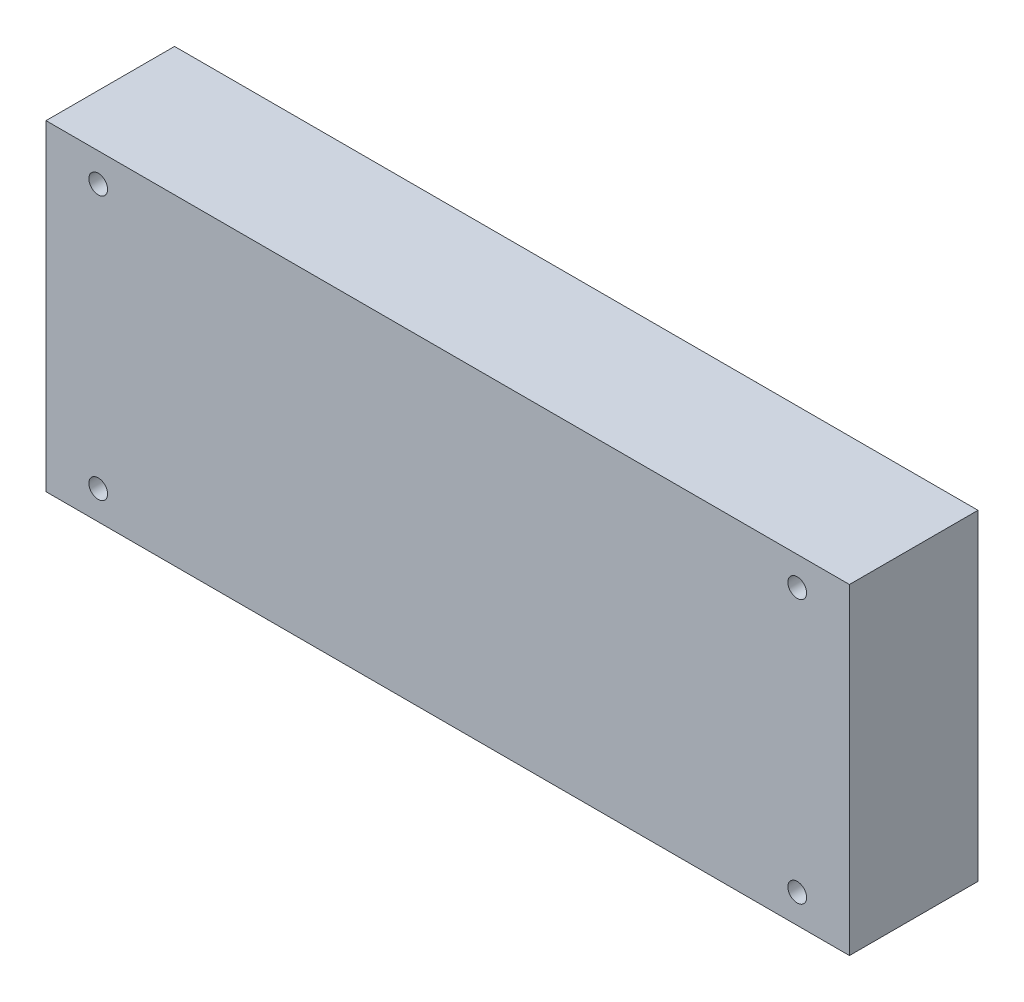
ISO-10303-21;
HEADER;
FILE_DESCRIPTION(('STEP AP214'),'2;1');
FILE_NAME('part.step','',(''),(''),'','','');
FILE_SCHEMA(('AUTOMOTIVE_DESIGN { 1 0 10303 214 1 1 1 1 }'));
ENDSEC;
DATA;
#1=APPLICATION_CONTEXT('core data for automotive mechanical design processes');
#2=APPLICATION_PROTOCOL_DEFINITION('international standard','automotive_design',2000,#1);
#3=PRODUCT_CONTEXT('',#1,'mechanical');
#4=PRODUCT('Part','Part','',(#3));
#5=PRODUCT_RELATED_PRODUCT_CATEGORY('part','',(#4));
#6=PRODUCT_DEFINITION_FORMATION('','',#4);
#7=PRODUCT_DEFINITION_CONTEXT('part definition',#1,'design');
#8=PRODUCT_DEFINITION('design','',#6,#7);
#9=PRODUCT_DEFINITION_SHAPE('','',#8);
#10=(LENGTH_UNIT() NAMED_UNIT(*) SI_UNIT(.MILLI.,.METRE.));
#11=(NAMED_UNIT(*) PLANE_ANGLE_UNIT() SI_UNIT($,.RADIAN.));
#12=(NAMED_UNIT(*) SI_UNIT($,.STERADIAN.) SOLID_ANGLE_UNIT());
#13=UNCERTAINTY_MEASURE_WITH_UNIT(LENGTH_MEASURE(1.E-05),#10,'distance_accuracy_value','');
#14=(GEOMETRIC_REPRESENTATION_CONTEXT(3) GLOBAL_UNCERTAINTY_ASSIGNED_CONTEXT((#13)) GLOBAL_UNIT_ASSIGNED_CONTEXT((#10,
#11,#12)) REPRESENTATION_CONTEXT('',''));
#15=CARTESIAN_POINT('',(0.,0.,0.));
#16=DIRECTION('',(0.,0.,1.));
#17=DIRECTION('',(1.,0.,0.));
#18=AXIS2_PLACEMENT_3D('',#15,#16,#17);
#19=CARTESIAN_POINT('',(9.75000000000001,54.625,24.));
#20=DIRECTION('',(0.,0.,-1.));
#21=DIRECTION('',(-1.,0.,0.));
#22=AXIS2_PLACEMENT_3D('',#19,#20,#21);
#23=CYLINDRICAL_SURFACE('',#22,1.75000000000001);
#24=CARTESIAN_POINT('',(9.75000000000001,54.625,24.));
#25=DIRECTION('',(0.,0.,-1.));
#26=DIRECTION('',(1.,0.,0.));
#27=AXIS2_PLACEMENT_3D('',#24,#25,#26);
#28=CIRCLE('',#27,1.75000000000001);
#29=CARTESIAN_POINT('',(11.5,54.625,24.));
#30=VERTEX_POINT('',#29);
#31=EDGE_CURVE('E277',#30,#30,#28,.T.);
#32=ORIENTED_EDGE('',*,*,#31,.F.);
#33=EDGE_LOOP('',(#32));
#34=FACE_BOUND('',#33,.T.);
#35=CARTESIAN_POINT('',(9.75000000000001,54.625,20.));
#36=DIRECTION('',(0.,0.,1.));
#37=DIRECTION('',(1.,0.,0.));
#38=AXIS2_PLACEMENT_3D('',#35,#36,#37);
#39=CIRCLE('',#38,1.75000000000001);
#40=CARTESIAN_POINT('',(11.5,54.625,20.));
#41=VERTEX_POINT('',#40);
#42=EDGE_CURVE('E291',#41,#41,#39,.T.);
#43=ORIENTED_EDGE('',*,*,#42,.F.);
#44=EDGE_LOOP('',(#43));
#45=FACE_BOUND('',#44,.T.);
#46=ADVANCED_FACE('F36',(#34,#45),#23,.F.);
#47=CARTESIAN_POINT('',(140.25,5.375,24.));
#48=DIRECTION('',(0.,0.,-1.));
#49=DIRECTION('',(-1.,0.,0.));
#50=AXIS2_PLACEMENT_3D('',#47,#48,#49);
#51=CYLINDRICAL_SURFACE('',#50,1.75000000000001);
#52=CARTESIAN_POINT('',(140.25,5.375,24.));
#53=DIRECTION('',(0.,0.,-1.));
#54=DIRECTION('',(1.,0.,0.));
#55=AXIS2_PLACEMENT_3D('',#52,#53,#54);
#56=CIRCLE('',#55,1.75000000000001);
#57=CARTESIAN_POINT('',(142.,5.375,24.));
#58=VERTEX_POINT('',#57);
#59=EDGE_CURVE('E276',#58,#58,#56,.T.);
#60=ORIENTED_EDGE('',*,*,#59,.F.);
#61=EDGE_LOOP('',(#60));
#62=FACE_BOUND('',#61,.T.);
#63=CARTESIAN_POINT('',(140.25,5.375,20.));
#64=DIRECTION('',(0.,0.,1.));
#65=DIRECTION('',(1.,0.,0.));
#66=AXIS2_PLACEMENT_3D('',#63,#64,#65);
#67=CIRCLE('',#66,1.75000000000001);
#68=CARTESIAN_POINT('',(142.,5.375,20.));
#69=VERTEX_POINT('',#68);
#70=EDGE_CURVE('E280',#69,#69,#67,.T.);
#71=ORIENTED_EDGE('',*,*,#70,.F.);
#72=EDGE_LOOP('',(#71));
#73=FACE_BOUND('',#72,.T.);
#74=ADVANCED_FACE('F423',(#62,#73),#51,.F.);
#75=CARTESIAN_POINT('',(4.50000000000001,56.,20.));
#76=DIRECTION('',(0.,-1.,0.));
#77=DIRECTION('',(1.,0.,0.));
#78=AXIS2_PLACEMENT_3D('',#75,#76,#77);
#79=PLANE('',#78);
#80=DIRECTION('',(0.,0.,-1.));
#81=VECTOR('',#80,1.);
#82=CARTESIAN_POINT('',(7.08365887403731,56.,20.));
#83=LINE('',#82,#81);
#84=CARTESIAN_POINT('',(7.08365887403731,56.,20.));
#85=VERTEX_POINT('',#84);
#86=CARTESIAN_POINT('',(7.08365887403731,56.,0.));
#87=VERTEX_POINT('',#86);
#88=EDGE_CURVE('E175',#85,#87,#83,.T.);
#89=ORIENTED_EDGE('',*,*,#88,.F.);
#90=DIRECTION('',(-1.,0.,0.));
#91=VECTOR('',#90,1.);
#92=CARTESIAN_POINT('',(4.50000000000001,56.,20.));
#93=LINE('',#92,#91);
#94=CARTESIAN_POINT('',(4.50000000000001,56.,20.));
#95=VERTEX_POINT('',#94);
#96=EDGE_CURVE('E225',#85,#95,#93,.T.);
#97=ORIENTED_EDGE('',*,*,#96,.T.);
#98=DIRECTION('',(0.,0.,-1.));
#99=VECTOR('',#98,1.);
#100=CARTESIAN_POINT('',(4.50000000000001,56.,20.));
#101=LINE('',#100,#99);
#102=CARTESIAN_POINT('',(4.50000000000001,56.,0.));
#103=VERTEX_POINT('',#102);
#104=EDGE_CURVE('E196',#95,#103,#101,.T.);
#105=ORIENTED_EDGE('',*,*,#104,.T.);
#106=DIRECTION('',(-1.,0.,0.));
#107=VECTOR('',#106,1.);
#108=CARTESIAN_POINT('',(4.50000000000001,56.,0.));
#109=LINE('',#108,#107);
#110=EDGE_CURVE('E51',#87,#103,#109,.T.);
#111=ORIENTED_EDGE('',*,*,#110,.F.);
#112=EDGE_LOOP('',(#89,#97,#105,#111));
#113=FACE_BOUND('',#112,.T.);
#114=ADVANCED_FACE('F194',(#113),#79,.T.);
#115=CARTESIAN_POINT('',(4.5,4.00000000000003,20.));
#116=DIRECTION('',(0.,1.,0.));
#117=DIRECTION('',(-1.,0.,0.));
#118=AXIS2_PLACEMENT_3D('',#115,#116,#117);
#119=PLANE('',#118);
#120=DIRECTION('',(0.,0.,-1.));
#121=VECTOR('',#120,1.);
#122=CARTESIAN_POINT('',(12.4163411259627,4.00000000000003,20.));
#123=LINE('',#122,#121);
#124=CARTESIAN_POINT('',(12.4163411259627,4.00000000000003,20.));
#125=VERTEX_POINT('',#124);
#126=CARTESIAN_POINT('',(12.4163411259627,4.00000000000003,17.));
#127=VERTEX_POINT('',#126);
#128=EDGE_CURVE('E376',#125,#127,#123,.T.);
#129=ORIENTED_EDGE('',*,*,#128,.F.);
#130=DIRECTION('',(1.,0.,0.));
#131=VECTOR('',#130,1.);
#132=CARTESIAN_POINT('',(4.5,4.00000000000003,20.));
#133=LINE('',#132,#131);
#134=CARTESIAN_POINT('',(137.583658874037,3.99999999999999,20.));
#135=VERTEX_POINT('',#134);
#136=EDGE_CURVE('E214',#125,#135,#133,.T.);
#137=ORIENTED_EDGE('',*,*,#136,.T.);
#138=DIRECTION('',(0.,0.,-1.));
#139=VECTOR('',#138,1.);
#140=CARTESIAN_POINT('',(137.583658874037,4.,20.));
#141=LINE('',#140,#139);
#142=CARTESIAN_POINT('',(137.583658874037,4.,17.));
#143=VERTEX_POINT('',#142);
#144=EDGE_CURVE('E271',#143,#135,#141,.F.);
#145=ORIENTED_EDGE('',*,*,#144,.F.);
#146=DIRECTION('',(1.,0.,0.));
#147=VECTOR('',#146,1.);
#148=CARTESIAN_POINT('',(4.5,4.00000000000003,17.));
#149=LINE('',#148,#147);
#150=EDGE_CURVE('E340',#127,#143,#149,.T.);
#151=ORIENTED_EDGE('',*,*,#150,.F.);
#152=EDGE_LOOP('',(#129,#137,#145,#151));
#153=FACE_BOUND('',#152,.T.);
#154=ADVANCED_FACE('F399',(#153),#119,.T.);
#155=DIRECTION('',(0.,0.,-1.));
#156=VECTOR('',#155,1.);
#157=CARTESIAN_POINT('',(142.916341125963,4.,20.));
#158=LINE('',#157,#156);
#159=CARTESIAN_POINT('',(142.916341125963,3.99999999999999,20.));
#160=VERTEX_POINT('',#159);
#161=CARTESIAN_POINT('',(142.916341125963,3.99999999999999,0.));
#162=VERTEX_POINT('',#161);
#163=EDGE_CURVE('E274',#160,#162,#158,.T.);
#164=ORIENTED_EDGE('',*,*,#163,.F.);
#165=CARTESIAN_POINT('',(145.5,4.,20.));
#166=VERTEX_POINT('',#165);
#167=EDGE_CURVE('E208',#160,#166,#133,.T.);
#168=ORIENTED_EDGE('',*,*,#167,.T.);
#169=DIRECTION('',(0.,0.,-1.));
#170=VECTOR('',#169,1.);
#171=CARTESIAN_POINT('',(145.5,4.,20.));
#172=LINE('',#171,#170);
#173=CARTESIAN_POINT('',(145.5,4.,0.));
#174=VERTEX_POINT('',#173);
#175=EDGE_CURVE('E243',#166,#174,#172,.T.);
#176=ORIENTED_EDGE('',*,*,#175,.T.);
#177=DIRECTION('',(1.,0.,0.));
#178=VECTOR('',#177,1.);
#179=CARTESIAN_POINT('',(4.5,4.00000000000003,0.));
#180=LINE('',#179,#178);
#181=EDGE_CURVE('E232',#162,#174,#180,.T.);
#182=ORIENTED_EDGE('',*,*,#181,.F.);
#183=EDGE_LOOP('',(#164,#168,#176,#182));
#184=FACE_BOUND('',#183,.T.);
#185=ADVANCED_FACE('F244',(#184),#119,.T.);
#186=DIRECTION('',(0.,0.,-1.));
#187=VECTOR('',#186,1.);
#188=CARTESIAN_POINT('',(137.583658874037,56.,20.));
#189=LINE('',#188,#187);
#190=CARTESIAN_POINT('',(137.583658874037,56.,20.));
#191=VERTEX_POINT('',#190);
#192=CARTESIAN_POINT('',(137.583658874037,56.,0.));
#193=VERTEX_POINT('',#192);
#194=EDGE_CURVE('E259',#191,#193,#189,.T.);
#195=ORIENTED_EDGE('',*,*,#194,.F.);
#196=CARTESIAN_POINT('',(12.4163411259627,56.,20.));
#197=VERTEX_POINT('',#196);
#198=EDGE_CURVE('E229',#191,#197,#93,.T.);
#199=ORIENTED_EDGE('',*,*,#198,.T.);
#200=DIRECTION('',(0.,0.,-1.));
#201=VECTOR('',#200,1.);
#202=CARTESIAN_POINT('',(12.4163411259627,56.,20.));
#203=LINE('',#202,#201);
#204=CARTESIAN_POINT('',(12.4163411259627,56.,0.));
#205=VERTEX_POINT('',#204);
#206=EDGE_CURVE('E184',#205,#197,#203,.F.);
#207=ORIENTED_EDGE('',*,*,#206,.F.);
#208=EDGE_CURVE('E191',#193,#205,#109,.T.);
#209=ORIENTED_EDGE('',*,*,#208,.F.);
#210=EDGE_LOOP('',(#195,#199,#207,#209));
#211=FACE_BOUND('',#210,.T.);
#212=ADVANCED_FACE('F410',(#211),#79,.T.);
#213=CARTESIAN_POINT('',(0.,0.,0.));
#214=DIRECTION('',(0.,0.,-1.));
#215=DIRECTION('',(-1.,0.,0.));
#216=AXIS2_PLACEMENT_3D('',#213,#214,#215);
#217=PLANE('',#216);
#218=CARTESIAN_POINT('',(9.74999999999998,5.375,0.));
#219=DIRECTION('',(0.,0.,-1.));
#220=DIRECTION('',(1.,0.,0.));
#221=AXIS2_PLACEMENT_3D('',#218,#219,#220);
#222=CIRCLE('',#221,2.99999999999999);
#223=CARTESIAN_POINT('',(8.99999999999998,2.47026249034445,0.));
#224=VERTEX_POINT('',#223);
#225=CARTESIAN_POINT('',(7.08365887403728,4.00000000000003,0.));
#226=VERTEX_POINT('',#225);
#227=EDGE_CURVE('E389',#224,#226,#222,.T.);
#228=ORIENTED_EDGE('',*,*,#227,.F.);
#229=DIRECTION('',(0.,-1.,0.));
#230=VECTOR('',#229,1.);
#231=CARTESIAN_POINT('',(8.99999999999998,16.,0.));
#232=LINE('',#231,#230);
#233=CARTESIAN_POINT('',(8.99999999999998,0.,0.));
#234=VERTEX_POINT('',#233);
#235=EDGE_CURVE('E309',#224,#234,#232,.T.);
#236=ORIENTED_EDGE('',*,*,#235,.T.);
#237=DIRECTION('',(1.,0.,0.));
#238=VECTOR('',#237,1.);
#239=CARTESIAN_POINT('',(0.,0.,0.));
#240=LINE('',#239,#238);
#241=CARTESIAN_POINT('',(0.,0.,0.));
#242=VERTEX_POINT('',#241);
#243=EDGE_CURVE('E364',#242,#234,#240,.T.);
#244=ORIENTED_EDGE('',*,*,#243,.F.);
#245=DIRECTION('',(0.,-1.,0.));
#246=VECTOR('',#245,1.);
#247=CARTESIAN_POINT('',(0.,0.,0.));
#248=LINE('',#247,#246);
#249=CARTESIAN_POINT('',(0.,60.,0.));
#250=VERTEX_POINT('',#249);
#251=EDGE_CURVE('E337',#250,#242,#248,.T.);
#252=ORIENTED_EDGE('',*,*,#251,.F.);
#253=DIRECTION('',(-1.,0.,0.));
#254=VECTOR('',#253,1.);
#255=CARTESIAN_POINT('',(0.,60.,0.));
#256=LINE('',#255,#254);
#257=CARTESIAN_POINT('',(150.,60.,0.));
#258=VERTEX_POINT('',#257);
#259=EDGE_CURVE('E59',#258,#250,#256,.T.);
#260=ORIENTED_EDGE('',*,*,#259,.F.);
#261=DIRECTION('',(0.,1.,0.));
#262=VECTOR('',#261,1.);
#263=CARTESIAN_POINT('',(150.,0.,0.));
#264=LINE('',#263,#262);
#265=CARTESIAN_POINT('',(150.,0.,0.));
#266=VERTEX_POINT('',#265);
#267=EDGE_CURVE('E349',#266,#258,#264,.T.);
#268=ORIENTED_EDGE('',*,*,#267,.F.);
#269=CARTESIAN_POINT('',(141.,0.,0.));
#270=VERTEX_POINT('',#269);
#271=EDGE_CURVE('E363',#270,#266,#240,.T.);
#272=ORIENTED_EDGE('',*,*,#271,.F.);
#273=DIRECTION('',(0.,-1.,0.));
#274=VECTOR('',#273,1.);
#275=CARTESIAN_POINT('',(141.,16.,0.));
#276=LINE('',#275,#274);
#277=CARTESIAN_POINT('',(141.,2.47026249034446,0.));
#278=VERTEX_POINT('',#277);
#279=EDGE_CURVE('E315',#278,#270,#276,.T.);
#280=ORIENTED_EDGE('',*,*,#279,.F.);
#281=CARTESIAN_POINT('',(140.25,5.375,0.));
#282=DIRECTION('',(0.,0.,-1.));
#283=DIRECTION('',(-1.,0.,0.));
#284=AXIS2_PLACEMENT_3D('',#281,#282,#283);
#285=CIRCLE('',#284,2.99999999999999);
#286=EDGE_CURVE('E239',#162,#278,#285,.T.);
#287=ORIENTED_EDGE('',*,*,#286,.F.);
#288=ORIENTED_EDGE('',*,*,#181,.T.);
#289=DIRECTION('',(0.,1.,0.));
#290=VECTOR('',#289,1.);
#291=CARTESIAN_POINT('',(145.5,56.,0.));
#292=LINE('',#291,#290);
#293=CARTESIAN_POINT('',(145.5,56.,0.));
#294=VERTEX_POINT('',#293);
#295=EDGE_CURVE('E197',#174,#294,#292,.T.);
#296=ORIENTED_EDGE('',*,*,#295,.T.);
#297=CARTESIAN_POINT('',(142.916341125963,56.,0.));
#298=VERTEX_POINT('',#297);
#299=EDGE_CURVE('E199',#294,#298,#109,.T.);
#300=ORIENTED_EDGE('',*,*,#299,.T.);
#301=CARTESIAN_POINT('',(140.25,54.625,0.));
#302=DIRECTION('',(0.,0.,-1.));
#303=DIRECTION('',(1.,0.,0.));
#304=AXIS2_PLACEMENT_3D('',#301,#302,#303);
#305=CIRCLE('',#304,2.99999999999999);
#306=EDGE_CURVE('E385',#193,#298,#305,.T.);
#307=ORIENTED_EDGE('',*,*,#306,.F.);
#308=ORIENTED_EDGE('',*,*,#208,.T.);
#309=CARTESIAN_POINT('',(9.74999999999998,54.625,0.));
#310=DIRECTION('',(0.,0.,-1.));
#311=DIRECTION('',(-1.,0.,0.));
#312=AXIS2_PLACEMENT_3D('',#309,#310,#311);
#313=CIRCLE('',#312,2.99999999999999);
#314=EDGE_CURVE('E177',#87,#205,#313,.T.);
#315=ORIENTED_EDGE('',*,*,#314,.F.);
#316=ORIENTED_EDGE('',*,*,#110,.T.);
#317=DIRECTION('',(0.,-1.,0.));
#318=VECTOR('',#317,1.);
#319=CARTESIAN_POINT('',(4.50000000000001,56.,0.));
#320=LINE('',#319,#318);
#321=CARTESIAN_POINT('',(4.5,4.00000000000003,0.));
#322=VERTEX_POINT('',#321);
#323=EDGE_CURVE('E230',#103,#322,#320,.T.);
#324=ORIENTED_EDGE('',*,*,#323,.T.);
#325=EDGE_CURVE('E201',#322,#226,#180,.T.);
#326=ORIENTED_EDGE('',*,*,#325,.T.);
#327=EDGE_LOOP('',(#228,#236,#244,#252,#260,#268,#272,#280,#287,#288,#296,#300,#307,#308,#315,
#316,#324,#326));
#328=FACE_BOUND('',#327,.T.);
#329=ADVANCED_FACE('F188',(#328),#217,.T.);
#330=CARTESIAN_POINT('',(0.,0.,20.));
#331=DIRECTION('',(1.,0.,0.));
#332=DIRECTION('',(0.,1.,0.));
#333=AXIS2_PLACEMENT_3D('',#330,#331,#332);
#334=PLANE('',#333);
#335=ORIENTED_EDGE('',*,*,#251,.T.);
#336=DIRECTION('',(0.,0.,-1.));
#337=VECTOR('',#336,1.);
#338=CARTESIAN_POINT('',(0.,0.,20.));
#339=LINE('',#338,#337);
#340=CARTESIAN_POINT('',(0.,0.,24.));
#341=VERTEX_POINT('',#340);
#342=EDGE_CURVE('E335',#341,#242,#339,.T.);
#343=ORIENTED_EDGE('',*,*,#342,.F.);
#344=DIRECTION('',(0.,-1.,0.));
#345=VECTOR('',#344,1.);
#346=CARTESIAN_POINT('',(0.,60.,24.));
#347=LINE('',#346,#345);
#348=CARTESIAN_POINT('',(0.,60.,24.));
#349=VERTEX_POINT('',#348);
#350=EDGE_CURVE('E312',#349,#341,#347,.T.);
#351=ORIENTED_EDGE('',*,*,#350,.F.);
#352=DIRECTION('',(0.,0.,-1.));
#353=VECTOR('',#352,1.);
#354=CARTESIAN_POINT('',(0.,60.,20.));
#355=LINE('',#354,#353);
#356=EDGE_CURVE('E332',#349,#250,#355,.T.);
#357=ORIENTED_EDGE('',*,*,#356,.T.);
#358=EDGE_LOOP('',(#335,#343,#351,#357));
#359=FACE_BOUND('',#358,.T.);
#360=ADVANCED_FACE('F38',(#359),#334,.F.);
#361=CARTESIAN_POINT('',(0.,0.,20.));
#362=DIRECTION('',(0.,1.,0.));
#363=DIRECTION('',(-1.,0.,0.));
#364=AXIS2_PLACEMENT_3D('',#361,#362,#363);
#365=PLANE('',#364);
#366=ORIENTED_EDGE('',*,*,#243,.T.);
#367=DIRECTION('',(0.,0.,-1.));
#368=VECTOR('',#367,1.);
#369=CARTESIAN_POINT('',(8.99999999999998,0.,17.));
#370=LINE('',#369,#368);
#371=CARTESIAN_POINT('',(8.99999999999998,0.,17.));
#372=VERTEX_POINT('',#371);
#373=EDGE_CURVE('E300',#372,#234,#370,.T.);
#374=ORIENTED_EDGE('',*,*,#373,.F.);
#375=DIRECTION('',(-1.,0.,0.));
#376=VECTOR('',#375,1.);
#377=CARTESIAN_POINT('',(8.99999999999998,0.,17.));
#378=LINE('',#377,#376);
#379=CARTESIAN_POINT('',(141.,0.,17.));
#380=VERTEX_POINT('',#379);
#381=EDGE_CURVE('E306',#380,#372,#378,.T.);
#382=ORIENTED_EDGE('',*,*,#381,.F.);
#383=DIRECTION('',(0.,0.,1.));
#384=VECTOR('',#383,1.);
#385=CARTESIAN_POINT('',(141.,0.,17.));
#386=LINE('',#385,#384);
#387=EDGE_CURVE('E303',#270,#380,#386,.T.);
#388=ORIENTED_EDGE('',*,*,#387,.F.);
#389=ORIENTED_EDGE('',*,*,#271,.T.);
#390=DIRECTION('',(0.,0.,-1.));
#391=VECTOR('',#390,1.);
#392=CARTESIAN_POINT('',(150.,0.,20.));
#393=LINE('',#392,#391);
#394=CARTESIAN_POINT('',(150.,0.,24.));
#395=VERTEX_POINT('',#394);
#396=EDGE_CURVE('E341',#395,#266,#393,.T.);
#397=ORIENTED_EDGE('',*,*,#396,.F.);
#398=DIRECTION('',(1.,0.,0.));
#399=VECTOR('',#398,1.);
#400=CARTESIAN_POINT('',(0.,0.,24.));
#401=LINE('',#400,#399);
#402=EDGE_CURVE('E320',#341,#395,#401,.T.);
#403=ORIENTED_EDGE('',*,*,#402,.F.);
#404=ORIENTED_EDGE('',*,*,#342,.T.);
#405=EDGE_LOOP('',(#366,#374,#382,#388,#389,#397,#403,#404));
#406=FACE_BOUND('',#405,.T.);
#407=ADVANCED_FACE('F343',(#406),#365,.F.);
#408=CARTESIAN_POINT('',(150.,0.,20.));
#409=DIRECTION('',(-1.,0.,0.));
#410=DIRECTION('',(0.,0.,1.));
#411=AXIS2_PLACEMENT_3D('',#408,#409,#410);
#412=PLANE('',#411);
#413=ORIENTED_EDGE('',*,*,#267,.T.);
#414=DIRECTION('',(0.,0.,-1.));
#415=VECTOR('',#414,1.);
#416=CARTESIAN_POINT('',(150.,60.,20.));
#417=LINE('',#416,#415);
#418=CARTESIAN_POINT('',(150.,60.,24.));
#419=VERTEX_POINT('',#418);
#420=EDGE_CURVE('E348',#419,#258,#417,.T.);
#421=ORIENTED_EDGE('',*,*,#420,.F.);
#422=DIRECTION('',(0.,1.,0.));
#423=VECTOR('',#422,1.);
#424=CARTESIAN_POINT('',(150.,60.,24.));
#425=LINE('',#424,#423);
#426=EDGE_CURVE('E322',#395,#419,#425,.T.);
#427=ORIENTED_EDGE('',*,*,#426,.F.);
#428=ORIENTED_EDGE('',*,*,#396,.T.);
#429=EDGE_LOOP('',(#413,#421,#427,#428));
#430=FACE_BOUND('',#429,.T.);
#431=ADVANCED_FACE('F346',(#430),#412,.F.);
#432=CARTESIAN_POINT('',(0.,60.,20.));
#433=DIRECTION('',(0.,-1.,0.));
#434=DIRECTION('',(0.,0.,-1.));
#435=AXIS2_PLACEMENT_3D('',#432,#433,#434);
#436=PLANE('',#435);
#437=ORIENTED_EDGE('',*,*,#259,.T.);
#438=ORIENTED_EDGE('',*,*,#356,.F.);
#439=DIRECTION('',(-1.,0.,0.));
#440=VECTOR('',#439,1.);
#441=CARTESIAN_POINT('',(0.,60.,24.));
#442=LINE('',#441,#440);
#443=EDGE_CURVE('E218',#419,#349,#442,.T.);
#444=ORIENTED_EDGE('',*,*,#443,.F.);
#445=ORIENTED_EDGE('',*,*,#420,.T.);
#446=EDGE_LOOP('',(#437,#438,#444,#445));
#447=FACE_BOUND('',#446,.T.);
#448=ADVANCED_FACE('F611',(#447),#436,.F.);
#449=CARTESIAN_POINT('',(4.50000000000001,56.,20.));
#450=DIRECTION('',(1.,0.,0.));
#451=DIRECTION('',(0.,1.,0.));
#452=AXIS2_PLACEMENT_3D('',#449,#450,#451);
#453=PLANE('',#452);
#454=ORIENTED_EDGE('',*,*,#323,.F.);
#455=ORIENTED_EDGE('',*,*,#104,.F.);
#456=DIRECTION('',(0.,-1.,0.));
#457=VECTOR('',#456,1.);
#458=CARTESIAN_POINT('',(4.50000000000001,56.,20.));
#459=LINE('',#458,#457);
#460=CARTESIAN_POINT('',(4.5,4.00000000000003,20.));
#461=VERTEX_POINT('',#460);
#462=EDGE_CURVE('E205',#95,#461,#459,.T.);
#463=ORIENTED_EDGE('',*,*,#462,.T.);
#464=DIRECTION('',(0.,0.,-1.));
#465=VECTOR('',#464,1.);
#466=CARTESIAN_POINT('',(4.5,4.00000000000003,20.));
#467=LINE('',#466,#465);
#468=EDGE_CURVE('E248',#461,#322,#467,.T.);
#469=ORIENTED_EDGE('',*,*,#468,.T.);
#470=EDGE_LOOP('',(#454,#455,#463,#469));
#471=FACE_BOUND('',#470,.T.);
#472=ADVANCED_FACE('F369',(#471),#453,.T.);
#473=DIRECTION('',(0.,0.,-1.));
#474=VECTOR('',#473,1.);
#475=CARTESIAN_POINT('',(7.08365887403728,4.00000000000003,20.));
#476=LINE('',#475,#474);
#477=CARTESIAN_POINT('',(7.08365887403728,4.00000000000003,20.));
#478=VERTEX_POINT('',#477);
#479=EDGE_CURVE('E373',#226,#478,#476,.F.);
#480=ORIENTED_EDGE('',*,*,#479,.F.);
#481=ORIENTED_EDGE('',*,*,#325,.F.);
#482=ORIENTED_EDGE('',*,*,#468,.F.);
#483=EDGE_CURVE('E216',#461,#478,#133,.T.);
#484=ORIENTED_EDGE('',*,*,#483,.T.);
#485=EDGE_LOOP('',(#480,#481,#482,#484));
#486=FACE_BOUND('',#485,.T.);
#487=ADVANCED_FACE('F372',(#486),#119,.T.);
#488=CARTESIAN_POINT('',(145.5,56.,20.));
#489=DIRECTION('',(-1.,0.,0.));
#490=DIRECTION('',(0.,0.,1.));
#491=AXIS2_PLACEMENT_3D('',#488,#489,#490);
#492=PLANE('',#491);
#493=ORIENTED_EDGE('',*,*,#295,.F.);
#494=ORIENTED_EDGE('',*,*,#175,.F.);
#495=DIRECTION('',(0.,1.,0.));
#496=VECTOR('',#495,1.);
#497=CARTESIAN_POINT('',(145.5,56.,20.));
#498=LINE('',#497,#496);
#499=CARTESIAN_POINT('',(145.5,56.,20.));
#500=VERTEX_POINT('',#499);
#501=EDGE_CURVE('E222',#166,#500,#498,.T.);
#502=ORIENTED_EDGE('',*,*,#501,.T.);
#503=DIRECTION('',(0.,0.,-1.));
#504=VECTOR('',#503,1.);
#505=CARTESIAN_POINT('',(145.5,56.,20.));
#506=LINE('',#505,#504);
#507=EDGE_CURVE('E249',#500,#294,#506,.T.);
#508=ORIENTED_EDGE('',*,*,#507,.T.);
#509=EDGE_LOOP('',(#493,#494,#502,#508));
#510=FACE_BOUND('',#509,.T.);
#511=ADVANCED_FACE('F251',(#510),#492,.T.);
#512=DIRECTION('',(0.,0.,-1.));
#513=VECTOR('',#512,1.);
#514=CARTESIAN_POINT('',(142.916341125963,56.,20.));
#515=LINE('',#514,#513);
#516=CARTESIAN_POINT('',(142.916341125963,56.,20.));
#517=VERTEX_POINT('',#516);
#518=EDGE_CURVE('E183',#298,#517,#515,.F.);
#519=ORIENTED_EDGE('',*,*,#518,.F.);
#520=ORIENTED_EDGE('',*,*,#299,.F.);
#521=ORIENTED_EDGE('',*,*,#507,.F.);
#522=EDGE_CURVE('E226',#500,#517,#93,.T.);
#523=ORIENTED_EDGE('',*,*,#522,.T.);
#524=EDGE_LOOP('',(#519,#520,#521,#523));
#525=FACE_BOUND('',#524,.T.);
#526=ADVANCED_FACE('F256',(#525),#79,.T.);
#527=CARTESIAN_POINT('',(0.,0.,20.));
#528=DIRECTION('',(0.,0.,1.));
#529=DIRECTION('',(1.,0.,0.));
#530=AXIS2_PLACEMENT_3D('',#527,#528,#529);
#531=PLANE('',#530);
#532=ORIENTED_EDGE('',*,*,#96,.F.);
#533=CARTESIAN_POINT('',(9.74999999999998,54.625,20.));
#534=DIRECTION('',(0.,0.,-1.));
#535=DIRECTION('',(-1.,0.,0.));
#536=AXIS2_PLACEMENT_3D('',#533,#534,#535);
#537=CIRCLE('',#536,2.99999999999999);
#538=EDGE_CURVE('E180',#85,#197,#537,.T.);
#539=ORIENTED_EDGE('',*,*,#538,.T.);
#540=ORIENTED_EDGE('',*,*,#198,.F.);
#541=CARTESIAN_POINT('',(140.25,54.625,20.));
#542=DIRECTION('',(0.,0.,-1.));
#543=DIRECTION('',(1.,0.,0.));
#544=AXIS2_PLACEMENT_3D('',#541,#542,#543);
#545=CIRCLE('',#544,2.99999999999999);
#546=EDGE_CURVE('E387',#191,#517,#545,.T.);
#547=ORIENTED_EDGE('',*,*,#546,.T.);
#548=ORIENTED_EDGE('',*,*,#522,.F.);
#549=ORIENTED_EDGE('',*,*,#501,.F.);
#550=ORIENTED_EDGE('',*,*,#167,.F.);
#551=CARTESIAN_POINT('',(140.25,5.375,20.));
#552=DIRECTION('',(0.,0.,-1.));
#553=DIRECTION('',(-1.,0.,0.));
#554=AXIS2_PLACEMENT_3D('',#551,#552,#553);
#555=CIRCLE('',#554,2.99999999999999);
#556=EDGE_CURVE('E264',#160,#135,#555,.T.);
#557=ORIENTED_EDGE('',*,*,#556,.T.);
#558=ORIENTED_EDGE('',*,*,#136,.F.);
#559=CARTESIAN_POINT('',(9.74999999999998,5.375,20.));
#560=DIRECTION('',(0.,0.,-1.));
#561=DIRECTION('',(1.,0.,0.));
#562=AXIS2_PLACEMENT_3D('',#559,#560,#561);
#563=CIRCLE('',#562,2.99999999999999);
#564=EDGE_CURVE('E382',#125,#478,#563,.T.);
#565=ORIENTED_EDGE('',*,*,#564,.T.);
#566=ORIENTED_EDGE('',*,*,#483,.F.);
#567=ORIENTED_EDGE('',*,*,#462,.F.);
#568=EDGE_LOOP('',(#532,#539,#540,#547,#548,#549,#550,#557,#558,#565,#566,#567));
#569=FACE_BOUND('',#568,.T.);
#570=ORIENTED_EDGE('',*,*,#42,.T.);
#571=EDGE_LOOP('',(#570));
#572=FACE_BOUND('',#571,.T.);
#573=CARTESIAN_POINT('',(9.75000000000001,5.37500000000002,20.));
#574=DIRECTION('',(0.,0.,1.));
#575=DIRECTION('',(1.,0.,0.));
#576=AXIS2_PLACEMENT_3D('',#573,#574,#575);
#577=CIRCLE('',#576,1.75000000000001);
#578=CARTESIAN_POINT('',(11.5,5.37500000000002,20.));
#579=VERTEX_POINT('',#578);
#580=EDGE_CURVE('E288',#579,#579,#577,.T.);
#581=ORIENTED_EDGE('',*,*,#580,.T.);
#582=EDGE_LOOP('',(#581));
#583=FACE_BOUND('',#582,.T.);
#584=CARTESIAN_POINT('',(140.25,54.625,20.));
#585=DIRECTION('',(0.,0.,1.));
#586=DIRECTION('',(1.,0.,0.));
#587=AXIS2_PLACEMENT_3D('',#584,#585,#586);
#588=CIRCLE('',#587,1.75000000000001);
#589=CARTESIAN_POINT('',(142.,54.625,20.));
#590=VERTEX_POINT('',#589);
#591=EDGE_CURVE('E297',#590,#590,#588,.T.);
#592=ORIENTED_EDGE('',*,*,#591,.T.);
#593=EDGE_LOOP('',(#592));
#594=FACE_BOUND('',#593,.T.);
#595=ORIENTED_EDGE('',*,*,#70,.T.);
#596=EDGE_LOOP('',(#595));
#597=FACE_BOUND('',#596,.T.);
#598=ADVANCED_FACE('F393',(#569,#572,#583,#594,#597),#531,.F.);
#599=CARTESIAN_POINT('',(0.,0.,24.));
#600=DIRECTION('',(0.,0.,1.));
#601=DIRECTION('',(1.,0.,0.));
#602=AXIS2_PLACEMENT_3D('',#599,#600,#601);
#603=PLANE('',#602);
#604=ORIENTED_EDGE('',*,*,#31,.T.);
#605=EDGE_LOOP('',(#604));
#606=FACE_BOUND('',#605,.T.);
#607=CARTESIAN_POINT('',(9.75000000000001,5.37500000000002,24.));
#608=DIRECTION('',(0.,0.,-1.));
#609=DIRECTION('',(-1.,0.,0.));
#610=AXIS2_PLACEMENT_3D('',#607,#608,#609);
#611=CIRCLE('',#610,1.75000000000001);
#612=CARTESIAN_POINT('',(8.,5.37500000000002,24.));
#613=VERTEX_POINT('',#612);
#614=EDGE_CURVE('E281',#613,#613,#611,.T.);
#615=ORIENTED_EDGE('',*,*,#614,.T.);
#616=EDGE_LOOP('',(#615));
#617=FACE_BOUND('',#616,.T.);
#618=ORIENTED_EDGE('',*,*,#59,.T.);
#619=EDGE_LOOP('',(#618));
#620=FACE_BOUND('',#619,.T.);
#621=CARTESIAN_POINT('',(140.25,54.625,24.));
#622=DIRECTION('',(0.,0.,-1.));
#623=DIRECTION('',(-1.,0.,0.));
#624=AXIS2_PLACEMENT_3D('',#621,#622,#623);
#625=CIRCLE('',#624,1.75000000000001);
#626=CARTESIAN_POINT('',(138.5,54.625,24.));
#627=VERTEX_POINT('',#626);
#628=EDGE_CURVE('E294',#627,#627,#625,.T.);
#629=ORIENTED_EDGE('',*,*,#628,.T.);
#630=EDGE_LOOP('',(#629));
#631=FACE_BOUND('',#630,.T.);
#632=ORIENTED_EDGE('',*,*,#350,.T.);
#633=ORIENTED_EDGE('',*,*,#402,.T.);
#634=ORIENTED_EDGE('',*,*,#426,.T.);
#635=ORIENTED_EDGE('',*,*,#443,.T.);
#636=EDGE_LOOP('',(#632,#633,#634,#635));
#637=FACE_BOUND('',#636,.T.);
#638=ADVANCED_FACE('F329',(#606,#617,#620,#631,#637),#603,.T.);
#639=CARTESIAN_POINT('',(8.99999999999998,16.,17.));
#640=DIRECTION('',(-1.,0.,0.));
#641=DIRECTION('',(0.,0.,1.));
#642=AXIS2_PLACEMENT_3D('',#639,#640,#641);
#643=PLANE('',#642);
#644=ORIENTED_EDGE('',*,*,#235,.F.);
#645=DIRECTION('',(0.,0.,-1.));
#646=VECTOR('',#645,1.);
#647=CARTESIAN_POINT('',(8.99999999999998,2.47026249034445,20.));
#648=LINE('',#647,#646);
#649=CARTESIAN_POINT('',(8.99999999999998,2.47026249034445,17.));
#650=VERTEX_POINT('',#649);
#651=EDGE_CURVE('E378',#224,#650,#648,.F.);
#652=ORIENTED_EDGE('',*,*,#651,.T.);
#653=DIRECTION('',(0.,-1.,0.));
#654=VECTOR('',#653,1.);
#655=CARTESIAN_POINT('',(8.99999999999998,16.,17.));
#656=LINE('',#655,#654);
#657=EDGE_CURVE('E310',#650,#372,#656,.T.);
#658=ORIENTED_EDGE('',*,*,#657,.T.);
#659=ORIENTED_EDGE('',*,*,#373,.T.);
#660=EDGE_LOOP('',(#644,#652,#658,#659));
#661=FACE_BOUND('',#660,.T.);
#662=ADVANCED_FACE('F447',(#661),#643,.F.);
#663=CARTESIAN_POINT('',(8.99999999999998,16.,17.));
#664=DIRECTION('',(0.,0.,1.));
#665=DIRECTION('',(1.,0.,0.));
#666=AXIS2_PLACEMENT_3D('',#663,#664,#665);
#667=PLANE('',#666);
#668=ORIENTED_EDGE('',*,*,#657,.F.);
#669=CARTESIAN_POINT('',(9.74999999999998,5.375,17.));
#670=DIRECTION('',(0.,0.,1.));
#671=DIRECTION('',(1.,0.,0.));
#672=AXIS2_PLACEMENT_3D('',#669,#670,#671);
#673=CIRCLE('',#672,2.99999999999999);
#674=EDGE_CURVE('E11',#650,#127,#673,.T.);
#675=ORIENTED_EDGE('',*,*,#674,.T.);
#676=ORIENTED_EDGE('',*,*,#150,.T.);
#677=CARTESIAN_POINT('',(140.25,5.375,17.));
#678=DIRECTION('',(0.,0.,1.));
#679=DIRECTION('',(1.,0.,0.));
#680=AXIS2_PLACEMENT_3D('',#677,#678,#679);
#681=CIRCLE('',#680,2.99999999999999);
#682=CARTESIAN_POINT('',(141.,2.47026249034446,17.));
#683=VERTEX_POINT('',#682);
#684=EDGE_CURVE('E267',#143,#683,#681,.T.);
#685=ORIENTED_EDGE('',*,*,#684,.T.);
#686=DIRECTION('',(0.,-1.,0.));
#687=VECTOR('',#686,1.);
#688=CARTESIAN_POINT('',(141.,16.,17.));
#689=LINE('',#688,#687);
#690=EDGE_CURVE('E313',#683,#380,#689,.T.);
#691=ORIENTED_EDGE('',*,*,#690,.T.);
#692=ORIENTED_EDGE('',*,*,#381,.T.);
#693=EDGE_LOOP('',(#668,#675,#676,#685,#691,#692));
#694=FACE_BOUND('',#693,.T.);
#695=ADVANCED_FACE('F403',(#694),#667,.F.);
#696=CARTESIAN_POINT('',(141.,16.,17.));
#697=DIRECTION('',(1.,0.,0.));
#698=DIRECTION('',(0.,1.,0.));
#699=AXIS2_PLACEMENT_3D('',#696,#697,#698);
#700=PLANE('',#699);
#701=ORIENTED_EDGE('',*,*,#690,.F.);
#702=DIRECTION('',(0.,0.,-1.));
#703=VECTOR('',#702,1.);
#704=CARTESIAN_POINT('',(141.,2.47026249034446,20.));
#705=LINE('',#704,#703);
#706=EDGE_CURVE('E44',#683,#278,#705,.T.);
#707=ORIENTED_EDGE('',*,*,#706,.T.);
#708=ORIENTED_EDGE('',*,*,#279,.T.);
#709=ORIENTED_EDGE('',*,*,#387,.T.);
#710=EDGE_LOOP('',(#701,#707,#708,#709));
#711=FACE_BOUND('',#710,.T.);
#712=ADVANCED_FACE('F358',(#711),#700,.F.);
#713=CARTESIAN_POINT('',(140.25,54.625,24.));
#714=DIRECTION('',(0.,0.,-1.));
#715=DIRECTION('',(-1.,0.,0.));
#716=AXIS2_PLACEMENT_3D('',#713,#714,#715);
#717=CYLINDRICAL_SURFACE('',#716,1.75000000000001);
#718=ORIENTED_EDGE('',*,*,#591,.F.);
#719=EDGE_LOOP('',(#718));
#720=FACE_BOUND('',#719,.T.);
#721=ORIENTED_EDGE('',*,*,#628,.F.);
#722=EDGE_LOOP('',(#721));
#723=FACE_BOUND('',#722,.T.);
#724=ADVANCED_FACE('F439',(#720,#723),#717,.F.);
#725=CARTESIAN_POINT('',(9.75000000000001,5.37500000000002,24.));
#726=DIRECTION('',(0.,0.,-1.));
#727=DIRECTION('',(-1.,0.,0.));
#728=AXIS2_PLACEMENT_3D('',#725,#726,#727);
#729=CYLINDRICAL_SURFACE('',#728,1.75000000000001);
#730=ORIENTED_EDGE('',*,*,#580,.F.);
#731=EDGE_LOOP('',(#730));
#732=FACE_BOUND('',#731,.T.);
#733=ORIENTED_EDGE('',*,*,#614,.F.);
#734=EDGE_LOOP('',(#733));
#735=FACE_BOUND('',#734,.T.);
#736=ADVANCED_FACE('F437',(#732,#735),#729,.F.);
#737=CARTESIAN_POINT('',(140.25,5.375,20.));
#738=DIRECTION('',(0.,0.,-1.));
#739=DIRECTION('',(-1.,0.,0.));
#740=AXIS2_PLACEMENT_3D('',#737,#738,#739);
#741=CYLINDRICAL_SURFACE('',#740,2.99999999999999);
#742=ORIENTED_EDGE('',*,*,#163,.T.);
#743=ORIENTED_EDGE('',*,*,#286,.T.);
#744=ORIENTED_EDGE('',*,*,#706,.F.);
#745=ORIENTED_EDGE('',*,*,#684,.F.);
#746=ORIENTED_EDGE('',*,*,#144,.T.);
#747=ORIENTED_EDGE('',*,*,#556,.F.);
#748=EDGE_LOOP('',(#742,#743,#744,#745,#746,#747));
#749=FACE_BOUND('',#748,.T.);
#750=ADVANCED_FACE('F404',(#749),#741,.F.);
#751=CARTESIAN_POINT('',(9.74999999999998,54.625,20.));
#752=DIRECTION('',(0.,0.,-1.));
#753=DIRECTION('',(-1.,0.,0.));
#754=AXIS2_PLACEMENT_3D('',#751,#752,#753);
#755=CYLINDRICAL_SURFACE('',#754,2.99999999999999);
#756=ORIENTED_EDGE('',*,*,#88,.T.);
#757=ORIENTED_EDGE('',*,*,#314,.T.);
#758=ORIENTED_EDGE('',*,*,#206,.T.);
#759=ORIENTED_EDGE('',*,*,#538,.F.);
#760=EDGE_LOOP('',(#756,#757,#758,#759));
#761=FACE_BOUND('',#760,.T.);
#762=ADVANCED_FACE('F176',(#761),#755,.F.);
#763=CARTESIAN_POINT('',(9.74999999999998,5.375,20.));
#764=DIRECTION('',(0.,0.,-1.));
#765=DIRECTION('',(-1.,0.,0.));
#766=AXIS2_PLACEMENT_3D('',#763,#764,#765);
#767=CYLINDRICAL_SURFACE('',#766,2.99999999999999);
#768=ORIENTED_EDGE('',*,*,#479,.T.);
#769=ORIENTED_EDGE('',*,*,#564,.F.);
#770=ORIENTED_EDGE('',*,*,#128,.T.);
#771=ORIENTED_EDGE('',*,*,#674,.F.);
#772=ORIENTED_EDGE('',*,*,#651,.F.);
#773=ORIENTED_EDGE('',*,*,#227,.T.);
#774=EDGE_LOOP('',(#768,#769,#770,#771,#772,#773));
#775=FACE_BOUND('',#774,.T.);
#776=ADVANCED_FACE('F396',(#775),#767,.F.);
#777=CARTESIAN_POINT('',(140.25,54.625,20.));
#778=DIRECTION('',(0.,0.,-1.));
#779=DIRECTION('',(-1.,0.,0.));
#780=AXIS2_PLACEMENT_3D('',#777,#778,#779);
#781=CYLINDRICAL_SURFACE('',#780,2.99999999999999);
#782=ORIENTED_EDGE('',*,*,#194,.T.);
#783=ORIENTED_EDGE('',*,*,#306,.T.);
#784=ORIENTED_EDGE('',*,*,#518,.T.);
#785=ORIENTED_EDGE('',*,*,#546,.F.);
#786=EDGE_LOOP('',(#782,#783,#784,#785));
#787=FACE_BOUND('',#786,.T.);
#788=ADVANCED_FACE('F408',(#787),#781,.F.);
#789=CLOSED_SHELL('',(#46,#74,#114,#154,#185,#212,#329,#360,#407,#431,#448,#472,#487,#511,#526,
#598,#638,#662,#695,#712,#724,#736,#750,#762,#776,#788));
#790=MANIFOLD_SOLID_BREP('B2',#789);
#791=ADVANCED_BREP_SHAPE_REPRESENTATION('',(#18,#790),#14);
#792=SHAPE_DEFINITION_REPRESENTATION(#9,#791);
ENDSEC;
END-ISO-10303-21;
